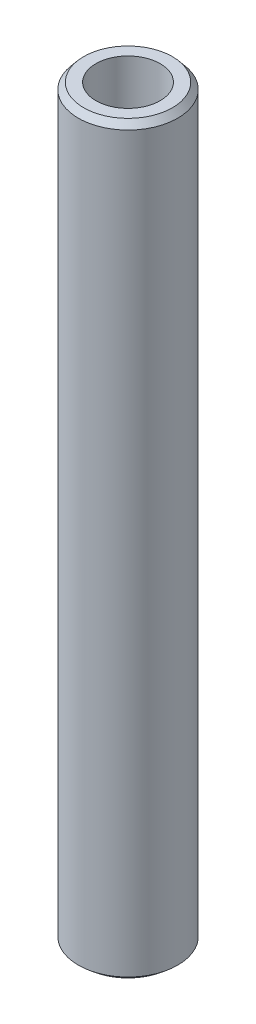
ISO-10303-21;
HEADER;
FILE_DESCRIPTION(('STEP AP214'),'2;1');
FILE_NAME('part.step','',(''),(''),'','','');
FILE_SCHEMA(('AUTOMOTIVE_DESIGN { 1 0 10303 214 1 1 1 1 }'));
ENDSEC;
DATA;
#1=APPLICATION_CONTEXT('core data for automotive mechanical design processes');
#2=APPLICATION_PROTOCOL_DEFINITION('international standard','automotive_design',2000,#1);
#3=PRODUCT_CONTEXT('',#1,'mechanical');
#4=PRODUCT('Part','Part','',(#3));
#5=PRODUCT_RELATED_PRODUCT_CATEGORY('part','',(#4));
#6=PRODUCT_DEFINITION_FORMATION('','',#4);
#7=PRODUCT_DEFINITION_CONTEXT('part definition',#1,'design');
#8=PRODUCT_DEFINITION('design','',#6,#7);
#9=PRODUCT_DEFINITION_SHAPE('','',#8);
#10=(LENGTH_UNIT() NAMED_UNIT(*) SI_UNIT(.MILLI.,.METRE.));
#11=(NAMED_UNIT(*) PLANE_ANGLE_UNIT() SI_UNIT($,.RADIAN.));
#12=(NAMED_UNIT(*) SI_UNIT($,.STERADIAN.) SOLID_ANGLE_UNIT());
#13=UNCERTAINTY_MEASURE_WITH_UNIT(LENGTH_MEASURE(1.E-05),#10,'distance_accuracy_value','');
#14=(GEOMETRIC_REPRESENTATION_CONTEXT(3) GLOBAL_UNCERTAINTY_ASSIGNED_CONTEXT((#13)) GLOBAL_UNIT_ASSIGNED_CONTEXT((#10,
#11,#12)) REPRESENTATION_CONTEXT('',''));
#15=CARTESIAN_POINT('',(0.,0.,0.));
#16=DIRECTION('',(0.,0.,1.));
#17=DIRECTION('',(1.,0.,0.));
#18=AXIS2_PLACEMENT_3D('',#15,#16,#17);
#19=CARTESIAN_POINT('',(0.,600.,0.));
#20=DIRECTION('',(0.,-1.,0.));
#21=DIRECTION('',(0.,0.,-1.));
#22=AXIS2_PLACEMENT_3D('',#19,#20,#21);
#23=CYLINDRICAL_SURFACE('',#22,40.);
#24=CARTESIAN_POINT('',(0.,594.869383809214,0.));
#25=DIRECTION('',(0.,1.,0.));
#26=DIRECTION('',(0.,0.,1.));
#27=AXIS2_PLACEMENT_3D('',#24,#25,#26);
#28=CIRCLE('',#27,40.);
#29=CARTESIAN_POINT('',(0.,594.869383809214,-40.));
#30=VERTEX_POINT('',#29);
#31=EDGE_CURVE('E50',#30,#30,#28,.F.);
#32=ORIENTED_EDGE('',*,*,#31,.T.);
#33=EDGE_LOOP('',(#32));
#34=FACE_BOUND('',#33,.T.);
#35=CARTESIAN_POINT('',(0.,4.28769992911027,0.));
#36=DIRECTION('',(0.,1.,0.));
#37=DIRECTION('',(0.,0.,1.));
#38=AXIS2_PLACEMENT_3D('',#35,#36,#37);
#39=CIRCLE('',#38,40.);
#40=CARTESIAN_POINT('',(0.,4.28769992911027,40.));
#41=VERTEX_POINT('',#40);
#42=EDGE_CURVE('E51',#41,#41,#39,.T.);
#43=ORIENTED_EDGE('',*,*,#42,.T.);
#44=EDGE_LOOP('',(#43));
#45=FACE_BOUND('',#44,.T.);
#46=ADVANCED_FACE('F39',(#34,#45),#23,.T.);
#47=CARTESIAN_POINT('',(0.,600.,0.));
#48=DIRECTION('',(0.,1.,0.));
#49=DIRECTION('',(0.,0.,1.));
#50=AXIS2_PLACEMENT_3D('',#47,#48,#49);
#51=PLANE('',#50);
#52=CARTESIAN_POINT('',(0.,600.,0.));
#53=DIRECTION('',(0.,1.,0.));
#54=DIRECTION('',(0.,0.,1.));
#55=AXIS2_PLACEMENT_3D('',#52,#53,#54);
#56=CIRCLE('',#55,35.7123000708896);
#57=CARTESIAN_POINT('',(0.,600.,-35.7123000708897));
#58=VERTEX_POINT('',#57);
#59=EDGE_CURVE('E54',#58,#58,#56,.T.);
#60=ORIENTED_EDGE('',*,*,#59,.T.);
#61=EDGE_LOOP('',(#60));
#62=FACE_BOUND('',#61,.T.);
#63=CARTESIAN_POINT('',(0.,600.,0.));
#64=DIRECTION('',(0.,1.,0.));
#65=DIRECTION('',(0.,0.,1.));
#66=AXIS2_PLACEMENT_3D('',#63,#64,#65);
#67=CIRCLE('',#66,25.8743644382244);
#68=CARTESIAN_POINT('',(0.,600.,25.8743644382244));
#69=VERTEX_POINT('',#68);
#70=EDGE_CURVE('E58',#69,#69,#67,.T.);
#71=ORIENTED_EDGE('',*,*,#70,.F.);
#72=EDGE_LOOP('',(#71));
#73=FACE_BOUND('',#72,.T.);
#74=ADVANCED_FACE('F69',(#62,#73),#51,.T.);
#75=CARTESIAN_POINT('',(0.,0.,0.));
#76=DIRECTION('',(0.,1.,0.));
#77=DIRECTION('',(0.,0.,1.));
#78=AXIS2_PLACEMENT_3D('',#75,#76,#77);
#79=PLANE('',#78);
#80=CARTESIAN_POINT('',(0.,0.,0.));
#81=DIRECTION('',(0.,1.,0.));
#82=DIRECTION('',(0.,0.,1.));
#83=AXIS2_PLACEMENT_3D('',#80,#81,#82);
#84=CIRCLE('',#83,34.869383809214);
#85=CARTESIAN_POINT('',(0.,0.,34.869383809214));
#86=VERTEX_POINT('',#85);
#87=EDGE_CURVE('E10',#86,#86,#84,.F.);
#88=ORIENTED_EDGE('',*,*,#87,.T.);
#89=EDGE_LOOP('',(#88));
#90=FACE_BOUND('',#89,.T.);
#91=CARTESIAN_POINT('',(0.,0.,0.));
#92=DIRECTION('',(0.,1.,0.));
#93=DIRECTION('',(0.,0.,1.));
#94=AXIS2_PLACEMENT_3D('',#91,#92,#93);
#95=CIRCLE('',#94,25.8743644382244);
#96=CARTESIAN_POINT('',(0.,0.,25.8743644382244));
#97=VERTEX_POINT('',#96);
#98=EDGE_CURVE('E63',#97,#97,#95,.T.);
#99=ORIENTED_EDGE('',*,*,#98,.T.);
#100=EDGE_LOOP('',(#99));
#101=FACE_BOUND('',#100,.T.);
#102=ADVANCED_FACE('F75',(#90,#101),#79,.F.);
#103=CARTESIAN_POINT('',(0.,600.,0.));
#104=DIRECTION('',(0.,-1.,0.));
#105=DIRECTION('',(0.,0.,-1.));
#106=AXIS2_PLACEMENT_3D('',#103,#104,#105);
#107=CYLINDRICAL_SURFACE('',#106,25.8743644382244);
#108=ORIENTED_EDGE('',*,*,#70,.T.);
#109=EDGE_LOOP('',(#108));
#110=FACE_BOUND('',#109,.T.);
#111=ORIENTED_EDGE('',*,*,#98,.F.);
#112=EDGE_LOOP('',(#111));
#113=FACE_BOUND('',#112,.T.);
#114=ADVANCED_FACE('F70',(#110,#113),#107,.F.);
#115=CARTESIAN_POINT('',(0.,600.,0.));
#116=DIRECTION('',(0.,-1.,0.));
#117=DIRECTION('',(0.,0.,-1.));
#118=AXIS2_PLACEMENT_3D('',#115,#116,#117);
#119=CONICAL_SURFACE('',#118,35.7123000708896,0.696138419764863);
#120=CARTESIAN_POINT('',(0.,594.869383809214,-40.));
#121=CARTESIAN_POINT('',(0.,594.922827727868,-39.9553364590718));
#122=CARTESIAN_POINT('',(0.,594.976271646522,-39.9106729181436));
#123=CARTESIAN_POINT('',(0.,595.08315948383,-39.8213458362871));
#124=CARTESIAN_POINT('',(0.,595.136603402484,-39.7766822953589));
#125=CARTESIAN_POINT('',(0.,595.243491239792,-39.6873552135024));
#126=CARTESIAN_POINT('',(0.,595.296935158446,-39.6426916725742));
#127=CARTESIAN_POINT('',(0.,595.403822995754,-39.5533645907177));
#128=CARTESIAN_POINT('',(0.,595.457266914408,-39.5087010497895));
#129=CARTESIAN_POINT('',(0.,595.564154751716,-39.419373967933));
#130=CARTESIAN_POINT('',(0.,595.61759867037,-39.3747104270048));
#131=CARTESIAN_POINT('',(0.,595.724486507678,-39.2853833451483));
#132=CARTESIAN_POINT('',(0.,595.777930426332,-39.2407198042201));
#133=CARTESIAN_POINT('',(0.,595.88481826364,-39.1513927223636));
#134=CARTESIAN_POINT('',(0.,595.938262182294,-39.1067291814354));
#135=CARTESIAN_POINT('',(0.,596.045150019602,-39.0174020995789));
#136=CARTESIAN_POINT('',(0.,596.098593938256,-38.9727385586507));
#137=CARTESIAN_POINT('',(0.,596.205481775564,-38.8834114767942));
#138=CARTESIAN_POINT('',(0.,596.258925694218,-38.838747935866));
#139=CARTESIAN_POINT('',(0.,596.365813531526,-38.7494208540095));
#140=CARTESIAN_POINT('',(0.,596.41925745018,-38.7047573130813));
#141=CARTESIAN_POINT('',(0.,596.526145287488,-38.6154302312248));
#142=CARTESIAN_POINT('',(0.,596.579589206142,-38.5707666902966));
#143=CARTESIAN_POINT('',(0.,596.686477043451,-38.4814396084401));
#144=CARTESIAN_POINT('',(0.,596.739920962105,-38.4367760675119));
#145=CARTESIAN_POINT('',(0.,596.846808799413,-38.3474489856554));
#146=CARTESIAN_POINT('',(0.,596.900252718067,-38.3027854447272));
#147=CARTESIAN_POINT('',(0.,597.007140555375,-38.2134583628707));
#148=CARTESIAN_POINT('',(0.,597.060584474029,-38.1687948219425));
#149=CARTESIAN_POINT('',(0.,597.167472311337,-38.079467740086));
#150=CARTESIAN_POINT('',(0.,597.220916229991,-38.0348041991578));
#151=CARTESIAN_POINT('',(0.,597.327804067299,-37.9454771173013));
#152=CARTESIAN_POINT('',(0.,597.381247985953,-37.9008135763731));
#153=CARTESIAN_POINT('',(0.,597.488135823261,-37.8114864945166));
#154=CARTESIAN_POINT('',(0.,597.541579741915,-37.7668229535884));
#155=CARTESIAN_POINT('',(0.,597.648467579223,-37.6774958717319));
#156=CARTESIAN_POINT('',(0.,597.701911497877,-37.6328323308037));
#157=CARTESIAN_POINT('',(0.,597.808799335185,-37.5435052489472));
#158=CARTESIAN_POINT('',(0.,597.862243253839,-37.498841708019));
#159=CARTESIAN_POINT('',(0.,597.969131091147,-37.4095146261625));
#160=CARTESIAN_POINT('',(0.,598.022575009801,-37.3648510852343));
#161=CARTESIAN_POINT('',(0.,598.129462847109,-37.2755240033778));
#162=CARTESIAN_POINT('',(0.,598.182906765763,-37.2308604624496));
#163=CARTESIAN_POINT('',(0.,598.289794603071,-37.1415333805931));
#164=CARTESIAN_POINT('',(0.,598.343238521725,-37.0968698396649));
#165=CARTESIAN_POINT('',(0.,598.450126359033,-37.0075427578084));
#166=CARTESIAN_POINT('',(0.,598.503570277687,-36.9628792168802));
#167=CARTESIAN_POINT('',(0.,598.610458114995,-36.8735521350237));
#168=CARTESIAN_POINT('',(0.,598.663902033649,-36.8288885940955));
#169=CARTESIAN_POINT('',(0.,598.770789870957,-36.739561512239));
#170=CARTESIAN_POINT('',(0.,598.824233789612,-36.6948979713108));
#171=CARTESIAN_POINT('',(0.,598.93112162692,-36.6055708894543));
#172=CARTESIAN_POINT('',(0.,598.984565545573,-36.5609073485261));
#173=CARTESIAN_POINT('',(0.,599.091453382881,-36.4715802666696));
#174=CARTESIAN_POINT('',(0.,599.144897301535,-36.4269167257414));
#175=CARTESIAN_POINT('',(0.,599.251785138844,-36.3375896438849));
#176=CARTESIAN_POINT('',(0.,599.305229057498,-36.2929261029567));
#177=CARTESIAN_POINT('',(0.,599.412116894806,-36.2035990211002));
#178=CARTESIAN_POINT('',(0.,599.46556081346,-36.158935480172));
#179=CARTESIAN_POINT('',(0.,599.572448650768,-36.0696083983155));
#180=CARTESIAN_POINT('',(0.,599.625892569422,-36.0249448573873));
#181=CARTESIAN_POINT('',(0.,599.73278040673,-35.9356177755308));
#182=CARTESIAN_POINT('',(0.,599.786224325384,-35.8909542346026));
#183=CARTESIAN_POINT('',(0.,599.893112162692,-35.8016271527461));
#184=CARTESIAN_POINT('',(0.,599.946556081346,-35.7569636118179));
#185=CARTESIAN_POINT('',(0.,600.,-35.7123000708897));
#186=B_SPLINE_CURVE_WITH_KNOTS('',3,(#120,#121,#122,#123,#124,#125,#126,#127,#128,#129,#130,
#131,#132,#133,#134,#135,#136,#137,#138,#139,#140,#141,#142,#143,#144,#145,#146,#147,#148,#149,
#150,#151,#152,#153,#154,#155,#156,#157,#158,#159,#160,#161,#162,#163,#164,#165,#166,#167,#168,
#169,#170,#171,#172,#173,#174,#175,#176,#177,#178,#179,#180,#181,#182,#183,#184,#185),
.UNSPECIFIED.,.F.,.F.,(4,2,2,2,2,2,2,2,2,2,2,2,2,2,2,2,2,2,2,2,2,2,2,2,2,2,2,2,2,2,2,2,4),(0.,
0.20894917794554,0.41789835589108,0.62684753383662,0.83579671178216,1.0447458897277,
1.25369506767324,1.4626442456187,1.67159342356424,1.88054260150978,2.08949177945532,
2.29844095740086,2.5073901353464,2.71633931329185,2.9252884912374,3.13423766918294,
3.34318684712848,3.55213602507402,3.76108520301956,3.9700343809651,4.17898355891055,
4.38793273685609,4.59688191480163,4.80583109274717,5.01478027069271,5.22372944863826,
5.43267862658371,5.64162780452925,5.8505769824748,6.05952616042033,6.26847533836588,
6.47742451631142,6.68637369425696),.UNSPECIFIED.);
#187=EDGE_CURVE('BSEAM81',#30,#58,#186,.T.);
#188=ORIENTED_EDGE('',*,*,#31,.F.);
#189=ORIENTED_EDGE('',*,*,#59,.F.);
#190=ORIENTED_EDGE('',*,*,#187,.T.);
#191=ORIENTED_EDGE('',*,*,#187,.F.);
#192=EDGE_LOOP('',(#188,#190,#189,#191));
#193=FACE_BOUND('',#192,.T.);
#194=ADVANCED_FACE('F81',(#193),#119,.T.);
#195=CARTESIAN_POINT('',(0.,4.28769992911027,0.));
#196=DIRECTION('',(0.,1.,0.));
#197=DIRECTION('',(0.,0.,1.));
#198=AXIS2_PLACEMENT_3D('',#195,#196,#197);
#199=CONICAL_SURFACE('',#198,40.,0.874657907030041);
#200=ORIENTED_EDGE('',*,*,#87,.F.);
#201=EDGE_LOOP('',(#200));
#202=FACE_BOUND('',#201,.T.);
#203=ORIENTED_EDGE('',*,*,#42,.F.);
#204=EDGE_LOOP('',(#203));
#205=FACE_BOUND('',#204,.T.);
#206=ADVANCED_FACE('F45',(#202,#205),#199,.T.);
#207=CLOSED_SHELL('',(#46,#74,#102,#114,#194,#206));
#208=MANIFOLD_SOLID_BREP('B2',#207);
#209=ADVANCED_BREP_SHAPE_REPRESENTATION('',(#18,#208),#14);
#210=SHAPE_DEFINITION_REPRESENTATION(#9,#209);
ENDSEC;
END-ISO-10303-21;
